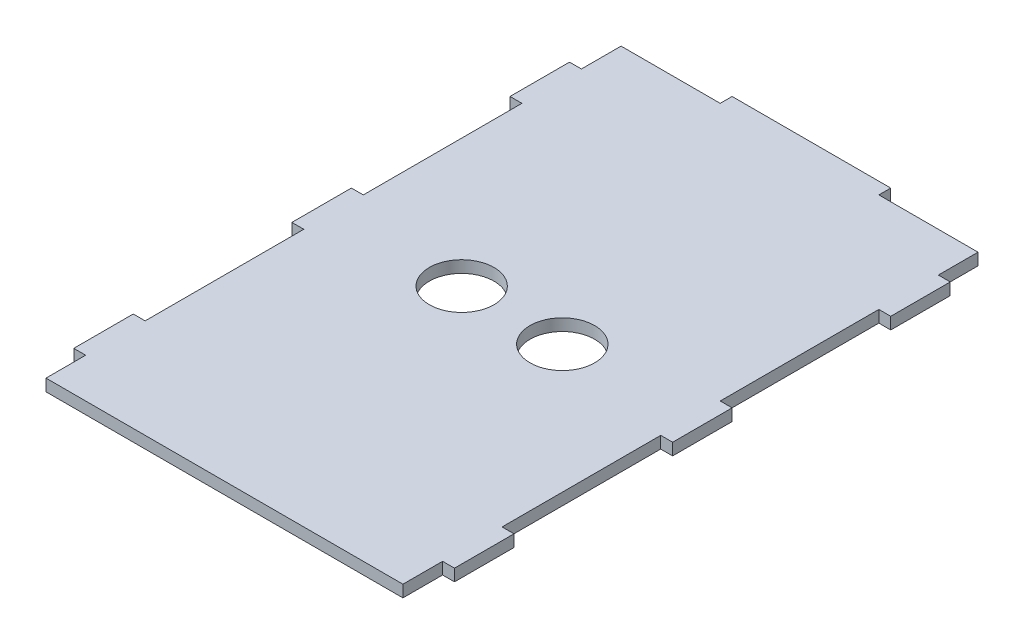
ISO-10303-21;
HEADER;
FILE_DESCRIPTION(('STEP AP214'),'2;1');
FILE_NAME('part.step','',(''),(''),'','','');
FILE_SCHEMA(('AUTOMOTIVE_DESIGN { 1 0 10303 214 1 1 1 1 }'));
ENDSEC;
DATA;
#1=APPLICATION_CONTEXT('core data for automotive mechanical design processes');
#2=APPLICATION_PROTOCOL_DEFINITION('international standard','automotive_design',2000,#1);
#3=PRODUCT_CONTEXT('',#1,'mechanical');
#4=PRODUCT('Part','Part','',(#3));
#5=PRODUCT_RELATED_PRODUCT_CATEGORY('part','',(#4));
#6=PRODUCT_DEFINITION_FORMATION('','',#4);
#7=PRODUCT_DEFINITION_CONTEXT('part definition',#1,'design');
#8=PRODUCT_DEFINITION('design','',#6,#7);
#9=PRODUCT_DEFINITION_SHAPE('','',#8);
#10=(LENGTH_UNIT() NAMED_UNIT(*) SI_UNIT(.MILLI.,.METRE.));
#11=(NAMED_UNIT(*) PLANE_ANGLE_UNIT() SI_UNIT($,.RADIAN.));
#12=(NAMED_UNIT(*) SI_UNIT($,.STERADIAN.) SOLID_ANGLE_UNIT());
#13=UNCERTAINTY_MEASURE_WITH_UNIT(LENGTH_MEASURE(1.E-05),#10,'distance_accuracy_value','');
#14=(GEOMETRIC_REPRESENTATION_CONTEXT(3) GLOBAL_UNCERTAINTY_ASSIGNED_CONTEXT((#13)) GLOBAL_UNIT_ASSIGNED_CONTEXT((#10,
#11,#12)) REPRESENTATION_CONTEXT('',''));
#15=CARTESIAN_POINT('',(0.,0.,0.));
#16=DIRECTION('',(0.,0.,1.));
#17=DIRECTION('',(1.,0.,0.));
#18=AXIS2_PLACEMENT_3D('',#15,#16,#17);
#19=CARTESIAN_POINT('',(0.,0.,-145.));
#20=DIRECTION('',(0.,0.,-1.));
#21=DIRECTION('',(-1.,0.,0.));
#22=AXIS2_PLACEMENT_3D('',#19,#20,#21);
#23=PLANE('',#22);
#24=DIRECTION('',(-1.,0.,0.));
#25=VECTOR('',#24,1.);
#26=CARTESIAN_POINT('',(0.,0.,-145.));
#27=LINE('',#26,#25);
#28=CARTESIAN_POINT('',(90.,0.,-145.));
#29=VERTEX_POINT('',#28);
#30=CARTESIAN_POINT('',(65.,0.,-145.));
#31=VERTEX_POINT('',#30);
#32=EDGE_CURVE('E273',#29,#31,#27,.T.);
#33=ORIENTED_EDGE('',*,*,#32,.T.);
#34=DIRECTION('',(0.,1.,0.));
#35=VECTOR('',#34,1.);
#36=CARTESIAN_POINT('',(65.,0.,-145.));
#37=LINE('',#36,#35);
#38=CARTESIAN_POINT('',(64.9999999999999,3.,-145.));
#39=VERTEX_POINT('',#38);
#40=EDGE_CURVE('E265',#31,#39,#37,.T.);
#41=ORIENTED_EDGE('',*,*,#40,.T.);
#42=DIRECTION('',(-1.,0.,0.));
#43=VECTOR('',#42,1.);
#44=CARTESIAN_POINT('',(0.,3.,-145.));
#45=LINE('',#44,#43);
#46=CARTESIAN_POINT('',(90.,3.,-145.));
#47=VERTEX_POINT('',#46);
#48=EDGE_CURVE('E274',#47,#39,#45,.T.);
#49=ORIENTED_EDGE('',*,*,#48,.F.);
#50=DIRECTION('',(0.,1.,0.));
#51=VECTOR('',#50,1.);
#52=CARTESIAN_POINT('',(90.,0.,-145.));
#53=LINE('',#52,#51);
#54=EDGE_CURVE('E277',#29,#47,#53,.T.);
#55=ORIENTED_EDGE('',*,*,#54,.F.);
#56=EDGE_LOOP('',(#33,#41,#49,#55));
#57=FACE_BOUND('',#56,.T.);
#58=ADVANCED_FACE('F33',(#57),#23,.T.);
#59=CARTESIAN_POINT('',(90.,3.,0.));
#60=DIRECTION('',(-1.,0.,0.));
#61=DIRECTION('',(0.,0.,1.));
#62=AXIS2_PLACEMENT_3D('',#59,#60,#61);
#63=PLANE('',#62);
#64=DIRECTION('',(0.,0.,-1.));
#65=VECTOR('',#64,1.);
#66=CARTESIAN_POINT('',(90.,3.,0.));
#67=LINE('',#66,#65);
#68=CARTESIAN_POINT('',(90.,3.,-25.));
#69=VERTEX_POINT('',#68);
#70=CARTESIAN_POINT('',(90.,3.,-65.));
#71=VERTEX_POINT('',#70);
#72=EDGE_CURVE('E58',#69,#71,#67,.T.);
#73=ORIENTED_EDGE('',*,*,#72,.F.);
#74=DIRECTION('',(0.,1.,0.));
#75=VECTOR('',#74,1.);
#76=CARTESIAN_POINT('',(90.,0.,-25.));
#77=LINE('',#76,#75);
#78=CARTESIAN_POINT('',(90.,0.,-25.));
#79=VERTEX_POINT('',#78);
#80=EDGE_CURVE('E603',#79,#69,#77,.T.);
#81=ORIENTED_EDGE('',*,*,#80,.F.);
#82=DIRECTION('',(0.,0.,-1.));
#83=VECTOR('',#82,1.);
#84=CARTESIAN_POINT('',(90.,0.,0.));
#85=LINE('',#84,#83);
#86=CARTESIAN_POINT('',(90.,0.,-65.));
#87=VERTEX_POINT('',#86);
#88=EDGE_CURVE('E301',#79,#87,#85,.T.);
#89=ORIENTED_EDGE('',*,*,#88,.T.);
#90=DIRECTION('',(0.,1.,0.));
#91=VECTOR('',#90,1.);
#92=CARTESIAN_POINT('',(90.,0.,-65.));
#93=LINE('',#92,#91);
#94=EDGE_CURVE('E515',#87,#71,#93,.T.);
#95=ORIENTED_EDGE('',*,*,#94,.T.);
#96=EDGE_LOOP('',(#73,#81,#89,#95));
#97=FACE_BOUND('',#96,.T.);
#98=ADVANCED_FACE('F632',(#97),#63,.F.);
#99=CARTESIAN_POINT('',(90.,3.,-80.));
#100=VERTEX_POINT('',#99);
#101=CARTESIAN_POINT('',(90.,3.,-120.));
#102=VERTEX_POINT('',#101);
#103=EDGE_CURVE('E300',#100,#102,#67,.T.);
#104=ORIENTED_EDGE('',*,*,#103,.F.);
#105=DIRECTION('',(0.,1.,0.));
#106=VECTOR('',#105,1.);
#107=CARTESIAN_POINT('',(90.,0.,-80.));
#108=LINE('',#107,#106);
#109=CARTESIAN_POINT('',(90.,0.,-80.));
#110=VERTEX_POINT('',#109);
#111=EDGE_CURVE('E500',#110,#100,#108,.T.);
#112=ORIENTED_EDGE('',*,*,#111,.F.);
#113=CARTESIAN_POINT('',(90.,0.,-120.));
#114=VERTEX_POINT('',#113);
#115=EDGE_CURVE('E320',#110,#114,#85,.T.);
#116=ORIENTED_EDGE('',*,*,#115,.T.);
#117=DIRECTION('',(0.,1.,0.));
#118=VECTOR('',#117,1.);
#119=CARTESIAN_POINT('',(90.,0.,-120.));
#120=LINE('',#119,#118);
#121=EDGE_CURVE('E463',#114,#102,#120,.T.);
#122=ORIENTED_EDGE('',*,*,#121,.T.);
#123=EDGE_LOOP('',(#104,#112,#116,#122));
#124=FACE_BOUND('',#123,.T.);
#125=ADVANCED_FACE('F630',(#124),#63,.F.);
#126=DIRECTION('',(0.,1.,0.));
#127=VECTOR('',#126,1.);
#128=CARTESIAN_POINT('',(90.,0.,-135.));
#129=LINE('',#128,#127);
#130=CARTESIAN_POINT('',(90.,0.,-135.));
#131=VERTEX_POINT('',#130);
#132=CARTESIAN_POINT('',(90.,3.,-135.));
#133=VERTEX_POINT('',#132);
#134=EDGE_CURVE('E450',#131,#133,#129,.T.);
#135=ORIENTED_EDGE('',*,*,#134,.F.);
#136=EDGE_CURVE('E322',#131,#29,#85,.T.);
#137=ORIENTED_EDGE('',*,*,#136,.T.);
#138=ORIENTED_EDGE('',*,*,#54,.T.);
#139=EDGE_CURVE('E314',#133,#47,#67,.T.);
#140=ORIENTED_EDGE('',*,*,#139,.F.);
#141=EDGE_LOOP('',(#135,#137,#138,#140));
#142=FACE_BOUND('',#141,.T.);
#143=ADVANCED_FACE('F524',(#142),#63,.F.);
#144=CARTESIAN_POINT('',(0.,3.,0.));
#145=DIRECTION('',(1.,0.,0.));
#146=DIRECTION('',(0.,0.,-1.));
#147=AXIS2_PLACEMENT_3D('',#144,#145,#146);
#148=PLANE('',#147);
#149=DIRECTION('',(0.,0.,1.));
#150=VECTOR('',#149,1.);
#151=CARTESIAN_POINT('',(0.,0.,0.));
#152=LINE('',#151,#150);
#153=CARTESIAN_POINT('',(0.,0.,-65.));
#154=VERTEX_POINT('',#153);
#155=CARTESIAN_POINT('',(0.,0.,-25.));
#156=VERTEX_POINT('',#155);
#157=EDGE_CURVE('E351',#154,#156,#152,.T.);
#158=ORIENTED_EDGE('',*,*,#157,.T.);
#159=DIRECTION('',(0.,1.,0.));
#160=VECTOR('',#159,1.);
#161=CARTESIAN_POINT('',(0.,0.,-25.));
#162=LINE('',#161,#160);
#163=CARTESIAN_POINT('',(0.,3.,-25.));
#164=VERTEX_POINT('',#163);
#165=EDGE_CURVE('E437',#156,#164,#162,.T.);
#166=ORIENTED_EDGE('',*,*,#165,.T.);
#167=DIRECTION('',(0.,0.,1.));
#168=VECTOR('',#167,1.);
#169=CARTESIAN_POINT('',(0.,3.,0.));
#170=LINE('',#169,#168);
#171=CARTESIAN_POINT('',(0.,3.,-65.));
#172=VERTEX_POINT('',#171);
#173=EDGE_CURVE('E336',#172,#164,#170,.T.);
#174=ORIENTED_EDGE('',*,*,#173,.F.);
#175=DIRECTION('',(0.,1.,0.));
#176=VECTOR('',#175,1.);
#177=CARTESIAN_POINT('',(0.,0.,-65.));
#178=LINE('',#177,#176);
#179=EDGE_CURVE('E408',#154,#172,#178,.T.);
#180=ORIENTED_EDGE('',*,*,#179,.F.);
#181=EDGE_LOOP('',(#158,#166,#174,#180));
#182=FACE_BOUND('',#181,.T.);
#183=ADVANCED_FACE('F638',(#182),#148,.F.);
#184=CARTESIAN_POINT('',(0.,0.,-120.));
#185=VERTEX_POINT('',#184);
#186=CARTESIAN_POINT('',(0.,0.,-80.));
#187=VERTEX_POINT('',#186);
#188=EDGE_CURVE('E353',#185,#187,#152,.T.);
#189=ORIENTED_EDGE('',*,*,#188,.T.);
#190=DIRECTION('',(0.,1.,0.));
#191=VECTOR('',#190,1.);
#192=CARTESIAN_POINT('',(0.,0.,-80.));
#193=LINE('',#192,#191);
#194=CARTESIAN_POINT('',(0.,3.,-80.));
#195=VERTEX_POINT('',#194);
#196=EDGE_CURVE('E402',#187,#195,#193,.T.);
#197=ORIENTED_EDGE('',*,*,#196,.T.);
#198=CARTESIAN_POINT('',(0.,3.,-120.));
#199=VERTEX_POINT('',#198);
#200=EDGE_CURVE('E343',#199,#195,#170,.T.);
#201=ORIENTED_EDGE('',*,*,#200,.F.);
#202=DIRECTION('',(0.,1.,0.));
#203=VECTOR('',#202,1.);
#204=CARTESIAN_POINT('',(0.,0.,-120.));
#205=LINE('',#204,#203);
#206=EDGE_CURVE('E367',#185,#199,#205,.T.);
#207=ORIENTED_EDGE('',*,*,#206,.F.);
#208=EDGE_LOOP('',(#189,#197,#201,#207));
#209=FACE_BOUND('',#208,.T.);
#210=ADVANCED_FACE('F538',(#209),#148,.F.);
#211=CARTESIAN_POINT('',(0.,3.,-10.));
#212=VERTEX_POINT('',#211);
#213=CARTESIAN_POINT('',(0.,3.,0.));
#214=VERTEX_POINT('',#213);
#215=EDGE_CURVE('E334',#212,#214,#170,.T.);
#216=ORIENTED_EDGE('',*,*,#215,.F.);
#217=DIRECTION('',(0.,1.,0.));
#218=VECTOR('',#217,1.);
#219=CARTESIAN_POINT('',(0.,0.,-10.));
#220=LINE('',#219,#218);
#221=CARTESIAN_POINT('',(0.,0.,-10.));
#222=VERTEX_POINT('',#221);
#223=EDGE_CURVE('E433',#222,#212,#220,.T.);
#224=ORIENTED_EDGE('',*,*,#223,.F.);
#225=CARTESIAN_POINT('',(0.,0.,0.));
#226=VERTEX_POINT('',#225);
#227=EDGE_CURVE('E337',#222,#226,#152,.T.);
#228=ORIENTED_EDGE('',*,*,#227,.T.);
#229=DIRECTION('',(0.,-1.,0.));
#230=VECTOR('',#229,1.);
#231=CARTESIAN_POINT('',(0.,3.,0.));
#232=LINE('',#231,#230);
#233=EDGE_CURVE('E11',#214,#226,#232,.T.);
#234=ORIENTED_EDGE('',*,*,#233,.F.);
#235=EDGE_LOOP('',(#216,#224,#228,#234));
#236=FACE_BOUND('',#235,.T.);
#237=ADVANCED_FACE('F904',(#236),#148,.F.);
#238=CARTESIAN_POINT('',(0.,0.,-145.));
#239=VERTEX_POINT('',#238);
#240=CARTESIAN_POINT('',(0.,0.,-135.));
#241=VERTEX_POINT('',#240);
#242=EDGE_CURVE('E271',#239,#241,#152,.T.);
#243=ORIENTED_EDGE('',*,*,#242,.T.);
#244=DIRECTION('',(0.,1.,0.));
#245=VECTOR('',#244,1.);
#246=CARTESIAN_POINT('',(0.,0.,-135.));
#247=LINE('',#246,#245);
#248=CARTESIAN_POINT('',(0.,3.,-135.));
#249=VERTEX_POINT('',#248);
#250=EDGE_CURVE('E369',#241,#249,#247,.T.);
#251=ORIENTED_EDGE('',*,*,#250,.T.);
#252=CARTESIAN_POINT('',(0.,3.,-145.));
#253=VERTEX_POINT('',#252);
#254=EDGE_CURVE('E347',#253,#249,#170,.T.);
#255=ORIENTED_EDGE('',*,*,#254,.F.);
#256=DIRECTION('',(0.,1.,0.));
#257=VECTOR('',#256,1.);
#258=CARTESIAN_POINT('',(0.,0.,-145.));
#259=LINE('',#258,#257);
#260=EDGE_CURVE('E293',#239,#253,#259,.T.);
#261=ORIENTED_EDGE('',*,*,#260,.F.);
#262=EDGE_LOOP('',(#243,#251,#255,#261));
#263=FACE_BOUND('',#262,.T.);
#264=ADVANCED_FACE('F35',(#263),#148,.F.);
#265=CARTESIAN_POINT('',(0.,3.,0.));
#266=DIRECTION('',(0.,0.,-1.));
#267=DIRECTION('',(-1.,0.,0.));
#268=AXIS2_PLACEMENT_3D('',#265,#266,#267);
#269=PLANE('',#268);
#270=DIRECTION('',(1.,0.,0.));
#271=VECTOR('',#270,1.);
#272=CARTESIAN_POINT('',(0.,0.,0.));
#273=LINE('',#272,#271);
#274=CARTESIAN_POINT('',(90.,0.,0.));
#275=VERTEX_POINT('',#274);
#276=EDGE_CURVE('E327',#226,#275,#273,.T.);
#277=ORIENTED_EDGE('',*,*,#276,.T.);
#278=DIRECTION('',(0.,-1.,0.));
#279=VECTOR('',#278,1.);
#280=CARTESIAN_POINT('',(90.,3.,0.));
#281=LINE('',#280,#279);
#282=CARTESIAN_POINT('',(90.,3.,0.));
#283=VERTEX_POINT('',#282);
#284=EDGE_CURVE('E42',#283,#275,#281,.T.);
#285=ORIENTED_EDGE('',*,*,#284,.F.);
#286=DIRECTION('',(1.,0.,0.));
#287=VECTOR('',#286,1.);
#288=CARTESIAN_POINT('',(0.,3.,0.));
#289=LINE('',#288,#287);
#290=EDGE_CURVE('E307',#214,#283,#289,.T.);
#291=ORIENTED_EDGE('',*,*,#290,.F.);
#292=ORIENTED_EDGE('',*,*,#233,.T.);
#293=EDGE_LOOP('',(#277,#285,#291,#292));
#294=FACE_BOUND('',#293,.T.);
#295=ADVANCED_FACE('F995',(#294),#269,.F.);
#296=CARTESIAN_POINT('',(90.,0.,-10.));
#297=VERTEX_POINT('',#296);
#298=EDGE_CURVE('E332',#275,#297,#85,.T.);
#299=ORIENTED_EDGE('',*,*,#298,.T.);
#300=DIRECTION('',(0.,1.,0.));
#301=VECTOR('',#300,1.);
#302=CARTESIAN_POINT('',(90.,0.,-10.));
#303=LINE('',#302,#301);
#304=CARTESIAN_POINT('',(90.,3.,-10.));
#305=VERTEX_POINT('',#304);
#306=EDGE_CURVE('E610',#297,#305,#303,.T.);
#307=ORIENTED_EDGE('',*,*,#306,.T.);
#308=EDGE_CURVE('E299',#283,#305,#67,.T.);
#309=ORIENTED_EDGE('',*,*,#308,.F.);
#310=ORIENTED_EDGE('',*,*,#284,.T.);
#311=EDGE_LOOP('',(#299,#307,#309,#310));
#312=FACE_BOUND('',#311,.T.);
#313=ADVANCED_FACE('F639',(#312),#63,.F.);
#314=CARTESIAN_POINT('',(0.,3.,0.));
#315=DIRECTION('',(0.,-1.,0.));
#316=DIRECTION('',(0.,0.,-1.));
#317=AXIS2_PLACEMENT_3D('',#314,#315,#316);
#318=PLANE('',#317);
#319=CARTESIAN_POINT('',(57.69,3.,-72.5));
#320=DIRECTION('',(0.,1.,0.));
#321=DIRECTION('',(0.,0.,1.));
#322=AXIS2_PLACEMENT_3D('',#319,#320,#321);
#323=CIRCLE('',#322,8.15);
#324=CARTESIAN_POINT('',(57.69,3.,-64.35));
#325=VERTEX_POINT('',#324);
#326=EDGE_CURVE('E584',#325,#325,#323,.T.);
#327=ORIENTED_EDGE('',*,*,#326,.F.);
#328=EDGE_LOOP('',(#327));
#329=FACE_BOUND('',#328,.T.);
#330=CARTESIAN_POINT('',(32.31,3.,-72.5));
#331=DIRECTION('',(0.,1.,0.));
#332=DIRECTION('',(0.,0.,1.));
#333=AXIS2_PLACEMENT_3D('',#330,#331,#332);
#334=CIRCLE('',#333,8.15);
#335=CARTESIAN_POINT('',(32.31,3.,-64.35));
#336=VERTEX_POINT('',#335);
#337=EDGE_CURVE('E576',#336,#336,#334,.T.);
#338=ORIENTED_EDGE('',*,*,#337,.F.);
#339=EDGE_LOOP('',(#338));
#340=FACE_BOUND('',#339,.T.);
#341=ORIENTED_EDGE('',*,*,#254,.T.);
#342=DIRECTION('',(-1.,0.,0.));
#343=VECTOR('',#342,1.);
#344=CARTESIAN_POINT('',(-3.00000000000001,3.,-135.));
#345=LINE('',#344,#343);
#346=CARTESIAN_POINT('',(-3.00000000000001,3.,-135.));
#347=VERTEX_POINT('',#346);
#348=EDGE_CURVE('E359',#249,#347,#345,.T.);
#349=ORIENTED_EDGE('',*,*,#348,.T.);
#350=DIRECTION('',(0.,0.,1.));
#351=VECTOR('',#350,1.);
#352=CARTESIAN_POINT('',(-3.00000000000001,3.,-135.));
#353=LINE('',#352,#351);
#354=CARTESIAN_POINT('',(-3.00000000000001,3.,-120.));
#355=VERTEX_POINT('',#354);
#356=EDGE_CURVE('E360',#347,#355,#353,.T.);
#357=ORIENTED_EDGE('',*,*,#356,.T.);
#358=DIRECTION('',(1.,0.,0.));
#359=VECTOR('',#358,1.);
#360=CARTESIAN_POINT('',(-3.00000000000001,3.,-120.));
#361=LINE('',#360,#359);
#362=EDGE_CURVE('E356',#355,#199,#361,.T.);
#363=ORIENTED_EDGE('',*,*,#362,.T.);
#364=ORIENTED_EDGE('',*,*,#200,.T.);
#365=DIRECTION('',(-1.,0.,0.));
#366=VECTOR('',#365,1.);
#367=CARTESIAN_POINT('',(-3.,3.,-80.));
#368=LINE('',#367,#366);
#369=CARTESIAN_POINT('',(-3.,3.,-80.));
#370=VERTEX_POINT('',#369);
#371=EDGE_CURVE('E413',#195,#370,#368,.T.);
#372=ORIENTED_EDGE('',*,*,#371,.T.);
#373=DIRECTION('',(0.,0.,1.));
#374=VECTOR('',#373,1.);
#375=CARTESIAN_POINT('',(-3.,3.,-80.));
#376=LINE('',#375,#374);
#377=CARTESIAN_POINT('',(-3.,3.,-65.));
#378=VERTEX_POINT('',#377);
#379=EDGE_CURVE('E420',#370,#378,#376,.T.);
#380=ORIENTED_EDGE('',*,*,#379,.T.);
#381=DIRECTION('',(1.,0.,0.));
#382=VECTOR('',#381,1.);
#383=CARTESIAN_POINT('',(-3.,3.,-65.));
#384=LINE('',#383,#382);
#385=EDGE_CURVE('E417',#378,#172,#384,.T.);
#386=ORIENTED_EDGE('',*,*,#385,.T.);
#387=ORIENTED_EDGE('',*,*,#173,.T.);
#388=DIRECTION('',(-1.,0.,0.));
#389=VECTOR('',#388,1.);
#390=CARTESIAN_POINT('',(-3.,3.,-25.));
#391=LINE('',#390,#389);
#392=CARTESIAN_POINT('',(-3.,3.,-25.));
#393=VERTEX_POINT('',#392);
#394=EDGE_CURVE('E440',#164,#393,#391,.T.);
#395=ORIENTED_EDGE('',*,*,#394,.T.);
#396=DIRECTION('',(0.,0.,1.));
#397=VECTOR('',#396,1.);
#398=CARTESIAN_POINT('',(-3.,3.,-25.));
#399=LINE('',#398,#397);
#400=CARTESIAN_POINT('',(-3.,3.,-10.));
#401=VERTEX_POINT('',#400);
#402=EDGE_CURVE('E447',#393,#401,#399,.T.);
#403=ORIENTED_EDGE('',*,*,#402,.T.);
#404=DIRECTION('',(1.,0.,0.));
#405=VECTOR('',#404,1.);
#406=CARTESIAN_POINT('',(-3.,3.,-10.));
#407=LINE('',#406,#405);
#408=EDGE_CURVE('E444',#401,#212,#407,.T.);
#409=ORIENTED_EDGE('',*,*,#408,.T.);
#410=ORIENTED_EDGE('',*,*,#215,.T.);
#411=ORIENTED_EDGE('',*,*,#290,.T.);
#412=ORIENTED_EDGE('',*,*,#308,.T.);
#413=DIRECTION('',(1.,0.,0.));
#414=VECTOR('',#413,1.);
#415=CARTESIAN_POINT('',(90.,3.,-10.));
#416=LINE('',#415,#414);
#417=CARTESIAN_POINT('',(93.,3.,-10.));
#418=VERTEX_POINT('',#417);
#419=EDGE_CURVE('E588',#305,#418,#416,.T.);
#420=ORIENTED_EDGE('',*,*,#419,.T.);
#421=DIRECTION('',(0.,0.,-1.));
#422=VECTOR('',#421,1.);
#423=CARTESIAN_POINT('',(93.,3.,-25.));
#424=LINE('',#423,#422);
#425=CARTESIAN_POINT('',(93.,3.,-25.));
#426=VERTEX_POINT('',#425);
#427=EDGE_CURVE('E592',#418,#426,#424,.T.);
#428=ORIENTED_EDGE('',*,*,#427,.T.);
#429=DIRECTION('',(-1.,0.,0.));
#430=VECTOR('',#429,1.);
#431=CARTESIAN_POINT('',(90.,3.,-25.));
#432=LINE('',#431,#430);
#433=EDGE_CURVE('E596',#426,#69,#432,.T.);
#434=ORIENTED_EDGE('',*,*,#433,.T.);
#435=ORIENTED_EDGE('',*,*,#72,.T.);
#436=DIRECTION('',(1.,0.,0.));
#437=VECTOR('',#436,1.);
#438=CARTESIAN_POINT('',(90.,3.,-65.));
#439=LINE('',#438,#437);
#440=CARTESIAN_POINT('',(93.,3.,-65.));
#441=VERTEX_POINT('',#440);
#442=EDGE_CURVE('E605',#71,#441,#439,.T.);
#443=ORIENTED_EDGE('',*,*,#442,.T.);
#444=DIRECTION('',(0.,0.,-1.));
#445=VECTOR('',#444,1.);
#446=CARTESIAN_POINT('',(93.,3.,-80.));
#447=LINE('',#446,#445);
#448=CARTESIAN_POINT('',(93.,3.,-80.));
#449=VERTEX_POINT('',#448);
#450=EDGE_CURVE('E620',#441,#449,#447,.T.);
#451=ORIENTED_EDGE('',*,*,#450,.T.);
#452=DIRECTION('',(-1.,0.,0.));
#453=VECTOR('',#452,1.);
#454=CARTESIAN_POINT('',(90.,3.,-80.));
#455=LINE('',#454,#453);
#456=EDGE_CURVE('E511',#449,#100,#455,.T.);
#457=ORIENTED_EDGE('',*,*,#456,.T.);
#458=ORIENTED_EDGE('',*,*,#103,.T.);
#459=DIRECTION('',(1.,0.,0.));
#460=VECTOR('',#459,1.);
#461=CARTESIAN_POINT('',(90.,3.,-120.));
#462=LINE('',#461,#460);
#463=CARTESIAN_POINT('',(93.,3.,-120.));
#464=VERTEX_POINT('',#463);
#465=EDGE_CURVE('E493',#102,#464,#462,.T.);
#466=ORIENTED_EDGE('',*,*,#465,.T.);
#467=DIRECTION('',(0.,0.,-1.));
#468=VECTOR('',#467,1.);
#469=CARTESIAN_POINT('',(93.,3.,-135.));
#470=LINE('',#469,#468);
#471=CARTESIAN_POINT('',(93.,3.,-135.));
#472=VERTEX_POINT('',#471);
#473=EDGE_CURVE('E482',#464,#472,#470,.T.);
#474=ORIENTED_EDGE('',*,*,#473,.T.);
#475=DIRECTION('',(-1.,0.,0.));
#476=VECTOR('',#475,1.);
#477=CARTESIAN_POINT('',(90.,3.,-135.));
#478=LINE('',#477,#476);
#479=EDGE_CURVE('E473',#472,#133,#478,.T.);
#480=ORIENTED_EDGE('',*,*,#479,.T.);
#481=ORIENTED_EDGE('',*,*,#139,.T.);
#482=ORIENTED_EDGE('',*,*,#48,.T.);
#483=DIRECTION('',(0.,0.,-1.));
#484=VECTOR('',#483,1.);
#485=CARTESIAN_POINT('',(65.,3.,-148.));
#486=LINE('',#485,#484);
#487=CARTESIAN_POINT('',(65.,3.,-148.));
#488=VERTEX_POINT('',#487);
#489=EDGE_CURVE('E50',#39,#488,#486,.T.);
#490=ORIENTED_EDGE('',*,*,#489,.T.);
#491=DIRECTION('',(-1.,0.,0.));
#492=VECTOR('',#491,1.);
#493=CARTESIAN_POINT('',(25.,3.,-148.));
#494=LINE('',#493,#492);
#495=CARTESIAN_POINT('',(25.,3.,-148.));
#496=VERTEX_POINT('',#495);
#497=EDGE_CURVE('E256',#488,#496,#494,.T.);
#498=ORIENTED_EDGE('',*,*,#497,.T.);
#499=DIRECTION('',(0.,0.,1.));
#500=VECTOR('',#499,1.);
#501=CARTESIAN_POINT('',(25.,3.,-148.));
#502=LINE('',#501,#500);
#503=CARTESIAN_POINT('',(25.,3.,-145.));
#504=VERTEX_POINT('',#503);
#505=EDGE_CURVE('E572',#496,#504,#502,.T.);
#506=ORIENTED_EDGE('',*,*,#505,.T.);
#507=EDGE_CURVE('E264',#504,#253,#45,.T.);
#508=ORIENTED_EDGE('',*,*,#507,.T.);
#509=EDGE_LOOP('',(#341,#349,#357,#363,#364,#372,#380,#386,#387,#395,#403,#409,#410,#411,#412,
#420,#428,#434,#435,#443,#451,#457,#458,#466,#474,#480,#481,#482,#490,#498,#506,#508));
#510=FACE_BOUND('',#509,.T.);
#511=ADVANCED_FACE('F400',(#329,#340,#510),#318,.F.);
#512=CARTESIAN_POINT('',(0.,0.,0.));
#513=DIRECTION('',(0.,-1.,0.));
#514=DIRECTION('',(0.,0.,-1.));
#515=AXIS2_PLACEMENT_3D('',#512,#513,#514);
#516=PLANE('',#515);
#517=CARTESIAN_POINT('',(57.69,0.,-72.5));
#518=DIRECTION('',(0.,1.,0.));
#519=DIRECTION('',(0.,0.,1.));
#520=AXIS2_PLACEMENT_3D('',#517,#518,#519);
#521=CIRCLE('',#520,8.15);
#522=CARTESIAN_POINT('',(57.69,0.,-64.35));
#523=VERTEX_POINT('',#522);
#524=EDGE_CURVE('E581',#523,#523,#521,.T.);
#525=ORIENTED_EDGE('',*,*,#524,.T.);
#526=EDGE_LOOP('',(#525));
#527=FACE_BOUND('',#526,.T.);
#528=CARTESIAN_POINT('',(32.31,0.,-72.5));
#529=DIRECTION('',(0.,1.,0.));
#530=DIRECTION('',(0.,0.,1.));
#531=AXIS2_PLACEMENT_3D('',#528,#529,#530);
#532=CIRCLE('',#531,8.15);
#533=CARTESIAN_POINT('',(32.31,0.,-64.35));
#534=VERTEX_POINT('',#533);
#535=EDGE_CURVE('E573',#534,#534,#532,.T.);
#536=ORIENTED_EDGE('',*,*,#535,.T.);
#537=EDGE_LOOP('',(#536));
#538=FACE_BOUND('',#537,.T.);
#539=ORIENTED_EDGE('',*,*,#242,.F.);
#540=CARTESIAN_POINT('',(25.,0.,-145.));
#541=VERTEX_POINT('',#540);
#542=EDGE_CURVE('E262',#541,#239,#27,.T.);
#543=ORIENTED_EDGE('',*,*,#542,.F.);
#544=DIRECTION('',(0.,0.,1.));
#545=VECTOR('',#544,1.);
#546=CARTESIAN_POINT('',(25.,0.,-148.));
#547=LINE('',#546,#545);
#548=CARTESIAN_POINT('',(25.,0.,-148.));
#549=VERTEX_POINT('',#548);
#550=EDGE_CURVE('E244',#549,#541,#547,.T.);
#551=ORIENTED_EDGE('',*,*,#550,.F.);
#552=DIRECTION('',(-1.,0.,0.));
#553=VECTOR('',#552,1.);
#554=CARTESIAN_POINT('',(25.,0.,-148.));
#555=LINE('',#554,#553);
#556=CARTESIAN_POINT('',(65.,0.,-148.));
#557=VERTEX_POINT('',#556);
#558=EDGE_CURVE('E266',#557,#549,#555,.T.);
#559=ORIENTED_EDGE('',*,*,#558,.F.);
#560=DIRECTION('',(0.,0.,-1.));
#561=VECTOR('',#560,1.);
#562=CARTESIAN_POINT('',(65.,0.,-148.));
#563=LINE('',#562,#561);
#564=EDGE_CURVE('E255',#31,#557,#563,.T.);
#565=ORIENTED_EDGE('',*,*,#564,.F.);
#566=ORIENTED_EDGE('',*,*,#32,.F.);
#567=ORIENTED_EDGE('',*,*,#136,.F.);
#568=DIRECTION('',(-1.,0.,0.));
#569=VECTOR('',#568,1.);
#570=CARTESIAN_POINT('',(90.,0.,-135.));
#571=LINE('',#570,#569);
#572=CARTESIAN_POINT('',(93.,0.,-135.));
#573=VERTEX_POINT('',#572);
#574=EDGE_CURVE('E467',#573,#131,#571,.T.);
#575=ORIENTED_EDGE('',*,*,#574,.F.);
#576=DIRECTION('',(0.,0.,-1.));
#577=VECTOR('',#576,1.);
#578=CARTESIAN_POINT('',(93.,0.,-135.));
#579=LINE('',#578,#577);
#580=CARTESIAN_POINT('',(93.,0.,-120.));
#581=VERTEX_POINT('',#580);
#582=EDGE_CURVE('E472',#581,#573,#579,.T.);
#583=ORIENTED_EDGE('',*,*,#582,.F.);
#584=DIRECTION('',(1.,0.,0.));
#585=VECTOR('',#584,1.);
#586=CARTESIAN_POINT('',(90.,0.,-120.));
#587=LINE('',#586,#585);
#588=EDGE_CURVE('E469',#114,#581,#587,.T.);
#589=ORIENTED_EDGE('',*,*,#588,.F.);
#590=ORIENTED_EDGE('',*,*,#115,.F.);
#591=DIRECTION('',(-1.,0.,0.));
#592=VECTOR('',#591,1.);
#593=CARTESIAN_POINT('',(90.,0.,-80.));
#594=LINE('',#593,#592);
#595=CARTESIAN_POINT('',(93.,0.,-80.));
#596=VERTEX_POINT('',#595);
#597=EDGE_CURVE('E516',#596,#110,#594,.T.);
#598=ORIENTED_EDGE('',*,*,#597,.F.);
#599=DIRECTION('',(0.,0.,-1.));
#600=VECTOR('',#599,1.);
#601=CARTESIAN_POINT('',(93.,0.,-80.));
#602=LINE('',#601,#600);
#603=CARTESIAN_POINT('',(93.,0.,-65.));
#604=VERTEX_POINT('',#603);
#605=EDGE_CURVE('E615',#604,#596,#602,.T.);
#606=ORIENTED_EDGE('',*,*,#605,.F.);
#607=DIRECTION('',(1.,0.,0.));
#608=VECTOR('',#607,1.);
#609=CARTESIAN_POINT('',(90.,0.,-65.));
#610=LINE('',#609,#608);
#611=EDGE_CURVE('E612',#87,#604,#610,.T.);
#612=ORIENTED_EDGE('',*,*,#611,.F.);
#613=ORIENTED_EDGE('',*,*,#88,.F.);
#614=DIRECTION('',(-1.,0.,0.));
#615=VECTOR('',#614,1.);
#616=CARTESIAN_POINT('',(90.,0.,-25.));
#617=LINE('',#616,#615);
#618=CARTESIAN_POINT('',(93.,0.,-25.));
#619=VERTEX_POINT('',#618);
#620=EDGE_CURVE('E599',#619,#79,#617,.T.);
#621=ORIENTED_EDGE('',*,*,#620,.F.);
#622=DIRECTION('',(0.,0.,-1.));
#623=VECTOR('',#622,1.);
#624=CARTESIAN_POINT('',(93.,0.,-25.));
#625=LINE('',#624,#623);
#626=CARTESIAN_POINT('',(93.,0.,-10.));
#627=VERTEX_POINT('',#626);
#628=EDGE_CURVE('E1029',#627,#619,#625,.T.);
#629=ORIENTED_EDGE('',*,*,#628,.F.);
#630=DIRECTION('',(1.,0.,0.));
#631=VECTOR('',#630,1.);
#632=CARTESIAN_POINT('',(90.,0.,-10.));
#633=LINE('',#632,#631);
#634=EDGE_CURVE('E567',#297,#627,#633,.T.);
#635=ORIENTED_EDGE('',*,*,#634,.F.);
#636=ORIENTED_EDGE('',*,*,#298,.F.);
#637=ORIENTED_EDGE('',*,*,#276,.F.);
#638=ORIENTED_EDGE('',*,*,#227,.F.);
#639=DIRECTION('',(1.,0.,0.));
#640=VECTOR('',#639,1.);
#641=CARTESIAN_POINT('',(-3.,0.,-10.));
#642=LINE('',#641,#640);
#643=CARTESIAN_POINT('',(-3.,0.,-10.));
#644=VERTEX_POINT('',#643);
#645=EDGE_CURVE('E453',#644,#222,#642,.T.);
#646=ORIENTED_EDGE('',*,*,#645,.F.);
#647=DIRECTION('',(0.,0.,1.));
#648=VECTOR('',#647,1.);
#649=CARTESIAN_POINT('',(-3.,0.,-25.));
#650=LINE('',#649,#648);
#651=CARTESIAN_POINT('',(-3.,0.,-25.));
#652=VERTEX_POINT('',#651);
#653=EDGE_CURVE('E443',#652,#644,#650,.T.);
#654=ORIENTED_EDGE('',*,*,#653,.F.);
#655=DIRECTION('',(-1.,0.,0.));
#656=VECTOR('',#655,1.);
#657=CARTESIAN_POINT('',(-3.,0.,-25.));
#658=LINE('',#657,#656);
#659=EDGE_CURVE('E434',#156,#652,#658,.T.);
#660=ORIENTED_EDGE('',*,*,#659,.F.);
#661=ORIENTED_EDGE('',*,*,#157,.F.);
#662=DIRECTION('',(1.,0.,0.));
#663=VECTOR('',#662,1.);
#664=CARTESIAN_POINT('',(-3.,0.,-65.));
#665=LINE('',#664,#663);
#666=CARTESIAN_POINT('',(-3.,0.,-65.));
#667=VERTEX_POINT('',#666);
#668=EDGE_CURVE('E426',#667,#154,#665,.T.);
#669=ORIENTED_EDGE('',*,*,#668,.F.);
#670=DIRECTION('',(0.,0.,1.));
#671=VECTOR('',#670,1.);
#672=CARTESIAN_POINT('',(-3.,0.,-80.));
#673=LINE('',#672,#671);
#674=CARTESIAN_POINT('',(-3.,0.,-80.));
#675=VERTEX_POINT('',#674);
#676=EDGE_CURVE('E416',#675,#667,#673,.T.);
#677=ORIENTED_EDGE('',*,*,#676,.F.);
#678=DIRECTION('',(-1.,0.,0.));
#679=VECTOR('',#678,1.);
#680=CARTESIAN_POINT('',(-3.,0.,-80.));
#681=LINE('',#680,#679);
#682=EDGE_CURVE('E409',#187,#675,#681,.T.);
#683=ORIENTED_EDGE('',*,*,#682,.F.);
#684=ORIENTED_EDGE('',*,*,#188,.F.);
#685=DIRECTION('',(1.,0.,0.));
#686=VECTOR('',#685,1.);
#687=CARTESIAN_POINT('',(-3.00000000000001,0.,-120.));
#688=LINE('',#687,#686);
#689=CARTESIAN_POINT('',(-3.00000000000001,0.,-120.));
#690=VERTEX_POINT('',#689);
#691=EDGE_CURVE('E363',#690,#185,#688,.T.);
#692=ORIENTED_EDGE('',*,*,#691,.F.);
#693=DIRECTION('',(0.,0.,1.));
#694=VECTOR('',#693,1.);
#695=CARTESIAN_POINT('',(-3.00000000000001,0.,-135.));
#696=LINE('',#695,#694);
#697=CARTESIAN_POINT('',(-3.00000000000001,0.,-135.));
#698=VERTEX_POINT('',#697);
#699=EDGE_CURVE('E366',#698,#690,#696,.T.);
#700=ORIENTED_EDGE('',*,*,#699,.F.);
#701=DIRECTION('',(-1.,0.,0.));
#702=VECTOR('',#701,1.);
#703=CARTESIAN_POINT('',(-3.00000000000001,0.,-135.));
#704=LINE('',#703,#702);
#705=EDGE_CURVE('E365',#241,#698,#704,.T.);
#706=ORIENTED_EDGE('',*,*,#705,.F.);
#707=EDGE_LOOP('',(#539,#543,#551,#559,#565,#566,#567,#575,#583,#589,#590,#598,#606,#612,#613,
#621,#629,#635,#636,#637,#638,#646,#654,#660,#661,#669,#677,#683,#684,#692,#700,#706));
#708=FACE_BOUND('',#707,.T.);
#709=ADVANCED_FACE('F268',(#527,#538,#708),#516,.T.);
#710=DIRECTION('',(0.,1.,0.));
#711=VECTOR('',#710,1.);
#712=CARTESIAN_POINT('',(25.,0.,-145.));
#713=LINE('',#712,#711);
#714=EDGE_CURVE('E248',#541,#504,#713,.T.);
#715=ORIENTED_EDGE('',*,*,#714,.F.);
#716=ORIENTED_EDGE('',*,*,#542,.T.);
#717=ORIENTED_EDGE('',*,*,#260,.T.);
#718=ORIENTED_EDGE('',*,*,#507,.F.);
#719=EDGE_LOOP('',(#715,#716,#717,#718));
#720=FACE_BOUND('',#719,.T.);
#721=ADVANCED_FACE('F260',(#720),#23,.T.);
#722=CARTESIAN_POINT('',(-3.00000000000001,0.,-135.));
#723=DIRECTION('',(-1.,0.,0.));
#724=DIRECTION('',(0.,0.,1.));
#725=AXIS2_PLACEMENT_3D('',#722,#723,#724);
#726=PLANE('',#725);
#727=ORIENTED_EDGE('',*,*,#356,.F.);
#728=DIRECTION('',(0.,1.,0.));
#729=VECTOR('',#728,1.);
#730=CARTESIAN_POINT('',(-3.00000000000001,0.,-135.));
#731=LINE('',#730,#729);
#732=EDGE_CURVE('E376',#698,#347,#731,.T.);
#733=ORIENTED_EDGE('',*,*,#732,.F.);
#734=ORIENTED_EDGE('',*,*,#699,.T.);
#735=DIRECTION('',(0.,1.,0.));
#736=VECTOR('',#735,1.);
#737=CARTESIAN_POINT('',(-3.00000000000001,0.,-120.));
#738=LINE('',#737,#736);
#739=EDGE_CURVE('E288',#690,#355,#738,.T.);
#740=ORIENTED_EDGE('',*,*,#739,.T.);
#741=EDGE_LOOP('',(#727,#733,#734,#740));
#742=FACE_BOUND('',#741,.T.);
#743=ADVANCED_FACE('F388',(#742),#726,.T.);
#744=CARTESIAN_POINT('',(-3.00000000000001,0.,-135.));
#745=DIRECTION('',(0.,0.,-1.));
#746=DIRECTION('',(-1.,0.,0.));
#747=AXIS2_PLACEMENT_3D('',#744,#745,#746);
#748=PLANE('',#747);
#749=ORIENTED_EDGE('',*,*,#348,.F.);
#750=ORIENTED_EDGE('',*,*,#250,.F.);
#751=ORIENTED_EDGE('',*,*,#705,.T.);
#752=ORIENTED_EDGE('',*,*,#732,.T.);
#753=EDGE_LOOP('',(#749,#750,#751,#752));
#754=FACE_BOUND('',#753,.T.);
#755=ADVANCED_FACE('F652',(#754),#748,.T.);
#756=CARTESIAN_POINT('',(-3.00000000000001,0.,-120.));
#757=DIRECTION('',(0.,0.,1.));
#758=DIRECTION('',(1.,0.,0.));
#759=AXIS2_PLACEMENT_3D('',#756,#757,#758);
#760=PLANE('',#759);
#761=ORIENTED_EDGE('',*,*,#362,.F.);
#762=ORIENTED_EDGE('',*,*,#739,.F.);
#763=ORIENTED_EDGE('',*,*,#691,.T.);
#764=ORIENTED_EDGE('',*,*,#206,.T.);
#765=EDGE_LOOP('',(#761,#762,#763,#764));
#766=FACE_BOUND('',#765,.T.);
#767=ADVANCED_FACE('F394',(#766),#760,.T.);
#768=CARTESIAN_POINT('',(-3.,0.,-80.));
#769=DIRECTION('',(-1.,0.,0.));
#770=DIRECTION('',(0.,0.,1.));
#771=AXIS2_PLACEMENT_3D('',#768,#769,#770);
#772=PLANE('',#771);
#773=ORIENTED_EDGE('',*,*,#379,.F.);
#774=DIRECTION('',(0.,1.,0.));
#775=VECTOR('',#774,1.);
#776=CARTESIAN_POINT('',(-3.,0.,-80.));
#777=LINE('',#776,#775);
#778=EDGE_CURVE('E401',#675,#370,#777,.T.);
#779=ORIENTED_EDGE('',*,*,#778,.F.);
#780=ORIENTED_EDGE('',*,*,#676,.T.);
#781=DIRECTION('',(0.,1.,0.));
#782=VECTOR('',#781,1.);
#783=CARTESIAN_POINT('',(-3.,0.,-65.));
#784=LINE('',#783,#782);
#785=EDGE_CURVE('E406',#667,#378,#784,.T.);
#786=ORIENTED_EDGE('',*,*,#785,.T.);
#787=EDGE_LOOP('',(#773,#779,#780,#786));
#788=FACE_BOUND('',#787,.T.);
#789=ADVANCED_FACE('F547',(#788),#772,.T.);
#790=CARTESIAN_POINT('',(-3.,0.,-80.));
#791=DIRECTION('',(0.,0.,-1.));
#792=DIRECTION('',(-1.,0.,0.));
#793=AXIS2_PLACEMENT_3D('',#790,#791,#792);
#794=PLANE('',#793);
#795=ORIENTED_EDGE('',*,*,#371,.F.);
#796=ORIENTED_EDGE('',*,*,#196,.F.);
#797=ORIENTED_EDGE('',*,*,#682,.T.);
#798=ORIENTED_EDGE('',*,*,#778,.T.);
#799=EDGE_LOOP('',(#795,#796,#797,#798));
#800=FACE_BOUND('',#799,.T.);
#801=ADVANCED_FACE('F542',(#800),#794,.T.);
#802=CARTESIAN_POINT('',(-3.,0.,-65.));
#803=DIRECTION('',(0.,0.,1.));
#804=DIRECTION('',(1.,0.,0.));
#805=AXIS2_PLACEMENT_3D('',#802,#803,#804);
#806=PLANE('',#805);
#807=ORIENTED_EDGE('',*,*,#385,.F.);
#808=ORIENTED_EDGE('',*,*,#785,.F.);
#809=ORIENTED_EDGE('',*,*,#668,.T.);
#810=ORIENTED_EDGE('',*,*,#179,.T.);
#811=EDGE_LOOP('',(#807,#808,#809,#810));
#812=FACE_BOUND('',#811,.T.);
#813=ADVANCED_FACE('F722',(#812),#806,.T.);
#814=CARTESIAN_POINT('',(-3.,0.,-25.));
#815=DIRECTION('',(-1.,0.,0.));
#816=DIRECTION('',(0.,0.,1.));
#817=AXIS2_PLACEMENT_3D('',#814,#815,#816);
#818=PLANE('',#817);
#819=ORIENTED_EDGE('',*,*,#402,.F.);
#820=DIRECTION('',(0.,1.,0.));
#821=VECTOR('',#820,1.);
#822=CARTESIAN_POINT('',(-3.,0.,-25.));
#823=LINE('',#822,#821);
#824=EDGE_CURVE('E423',#652,#393,#823,.T.);
#825=ORIENTED_EDGE('',*,*,#824,.F.);
#826=ORIENTED_EDGE('',*,*,#653,.T.);
#827=DIRECTION('',(0.,1.,0.));
#828=VECTOR('',#827,1.);
#829=CARTESIAN_POINT('',(-3.,0.,-10.));
#830=LINE('',#829,#828);
#831=EDGE_CURVE('E431',#644,#401,#830,.T.);
#832=ORIENTED_EDGE('',*,*,#831,.T.);
#833=EDGE_LOOP('',(#819,#825,#826,#832));
#834=FACE_BOUND('',#833,.T.);
#835=ADVANCED_FACE('F715',(#834),#818,.T.);
#836=CARTESIAN_POINT('',(-3.,0.,-25.));
#837=DIRECTION('',(0.,0.,-1.));
#838=DIRECTION('',(-1.,0.,0.));
#839=AXIS2_PLACEMENT_3D('',#836,#837,#838);
#840=PLANE('',#839);
#841=ORIENTED_EDGE('',*,*,#394,.F.);
#842=ORIENTED_EDGE('',*,*,#165,.F.);
#843=ORIENTED_EDGE('',*,*,#659,.T.);
#844=ORIENTED_EDGE('',*,*,#824,.T.);
#845=EDGE_LOOP('',(#841,#842,#843,#844));
#846=FACE_BOUND('',#845,.T.);
#847=ADVANCED_FACE('F712',(#846),#840,.T.);
#848=CARTESIAN_POINT('',(-3.,0.,-10.));
#849=DIRECTION('',(0.,0.,1.));
#850=DIRECTION('',(1.,0.,0.));
#851=AXIS2_PLACEMENT_3D('',#848,#849,#850);
#852=PLANE('',#851);
#853=ORIENTED_EDGE('',*,*,#408,.F.);
#854=ORIENTED_EDGE('',*,*,#831,.F.);
#855=ORIENTED_EDGE('',*,*,#645,.T.);
#856=ORIENTED_EDGE('',*,*,#223,.T.);
#857=EDGE_LOOP('',(#853,#854,#855,#856));
#858=FACE_BOUND('',#857,.T.);
#859=ADVANCED_FACE('F707',(#858),#852,.T.);
#860=CARTESIAN_POINT('',(90.,0.,-135.));
#861=DIRECTION('',(0.,0.,-1.));
#862=DIRECTION('',(-1.,0.,0.));
#863=AXIS2_PLACEMENT_3D('',#860,#861,#862);
#864=PLANE('',#863);
#865=ORIENTED_EDGE('',*,*,#479,.F.);
#866=DIRECTION('',(0.,1.,0.));
#867=VECTOR('',#866,1.);
#868=CARTESIAN_POINT('',(93.,0.,-135.));
#869=LINE('',#868,#867);
#870=EDGE_CURVE('E478',#573,#472,#869,.T.);
#871=ORIENTED_EDGE('',*,*,#870,.F.);
#872=ORIENTED_EDGE('',*,*,#574,.T.);
#873=ORIENTED_EDGE('',*,*,#134,.T.);
#874=EDGE_LOOP('',(#865,#871,#872,#873));
#875=FACE_BOUND('',#874,.T.);
#876=ADVANCED_FACE('F520',(#875),#864,.T.);
#877=CARTESIAN_POINT('',(93.,0.,-135.));
#878=DIRECTION('',(1.,0.,0.));
#879=DIRECTION('',(0.,0.,-1.));
#880=AXIS2_PLACEMENT_3D('',#877,#878,#879);
#881=PLANE('',#880);
#882=ORIENTED_EDGE('',*,*,#473,.F.);
#883=DIRECTION('',(0.,1.,0.));
#884=VECTOR('',#883,1.);
#885=CARTESIAN_POINT('',(93.,0.,-120.));
#886=LINE('',#885,#884);
#887=EDGE_CURVE('E460',#581,#464,#886,.T.);
#888=ORIENTED_EDGE('',*,*,#887,.F.);
#889=ORIENTED_EDGE('',*,*,#582,.T.);
#890=ORIENTED_EDGE('',*,*,#870,.T.);
#891=EDGE_LOOP('',(#882,#888,#889,#890));
#892=FACE_BOUND('',#891,.T.);
#893=ADVANCED_FACE('F496',(#892),#881,.T.);
#894=CARTESIAN_POINT('',(90.,0.,-120.));
#895=DIRECTION('',(0.,0.,1.));
#896=DIRECTION('',(1.,0.,0.));
#897=AXIS2_PLACEMENT_3D('',#894,#895,#896);
#898=PLANE('',#897);
#899=ORIENTED_EDGE('',*,*,#465,.F.);
#900=ORIENTED_EDGE('',*,*,#121,.F.);
#901=ORIENTED_EDGE('',*,*,#588,.T.);
#902=ORIENTED_EDGE('',*,*,#887,.T.);
#903=EDGE_LOOP('',(#899,#900,#901,#902));
#904=FACE_BOUND('',#903,.T.);
#905=ADVANCED_FACE('F490',(#904),#898,.T.);
#906=CARTESIAN_POINT('',(90.,0.,-80.));
#907=DIRECTION('',(0.,0.,-1.));
#908=DIRECTION('',(-1.,0.,0.));
#909=AXIS2_PLACEMENT_3D('',#906,#907,#908);
#910=PLANE('',#909);
#911=ORIENTED_EDGE('',*,*,#456,.F.);
#912=DIRECTION('',(0.,1.,0.));
#913=VECTOR('',#912,1.);
#914=CARTESIAN_POINT('',(93.,0.,-80.));
#915=LINE('',#914,#913);
#916=EDGE_CURVE('E502',#596,#449,#915,.T.);
#917=ORIENTED_EDGE('',*,*,#916,.F.);
#918=ORIENTED_EDGE('',*,*,#597,.T.);
#919=ORIENTED_EDGE('',*,*,#111,.T.);
#920=EDGE_LOOP('',(#911,#917,#918,#919));
#921=FACE_BOUND('',#920,.T.);
#922=ADVANCED_FACE('F623',(#921),#910,.T.);
#923=CARTESIAN_POINT('',(93.,0.,-80.));
#924=DIRECTION('',(1.,0.,0.));
#925=DIRECTION('',(0.,0.,-1.));
#926=AXIS2_PLACEMENT_3D('',#923,#924,#925);
#927=PLANE('',#926);
#928=ORIENTED_EDGE('',*,*,#450,.F.);
#929=DIRECTION('',(0.,1.,0.));
#930=VECTOR('',#929,1.);
#931=CARTESIAN_POINT('',(93.,0.,-65.));
#932=LINE('',#931,#930);
#933=EDGE_CURVE('E508',#604,#441,#932,.T.);
#934=ORIENTED_EDGE('',*,*,#933,.F.);
#935=ORIENTED_EDGE('',*,*,#605,.T.);
#936=ORIENTED_EDGE('',*,*,#916,.T.);
#937=EDGE_LOOP('',(#928,#934,#935,#936));
#938=FACE_BOUND('',#937,.T.);
#939=ADVANCED_FACE('F627',(#938),#927,.T.);
#940=CARTESIAN_POINT('',(90.,0.,-65.));
#941=DIRECTION('',(0.,0.,1.));
#942=DIRECTION('',(1.,0.,0.));
#943=AXIS2_PLACEMENT_3D('',#940,#941,#942);
#944=PLANE('',#943);
#945=ORIENTED_EDGE('',*,*,#442,.F.);
#946=ORIENTED_EDGE('',*,*,#94,.F.);
#947=ORIENTED_EDGE('',*,*,#611,.T.);
#948=ORIENTED_EDGE('',*,*,#933,.T.);
#949=EDGE_LOOP('',(#945,#946,#947,#948));
#950=FACE_BOUND('',#949,.T.);
#951=ADVANCED_FACE('F690',(#950),#944,.T.);
#952=CARTESIAN_POINT('',(90.,0.,-25.));
#953=DIRECTION('',(0.,0.,-1.));
#954=DIRECTION('',(-1.,0.,0.));
#955=AXIS2_PLACEMENT_3D('',#952,#953,#954);
#956=PLANE('',#955);
#957=ORIENTED_EDGE('',*,*,#433,.F.);
#958=DIRECTION('',(0.,1.,0.));
#959=VECTOR('',#958,1.);
#960=CARTESIAN_POINT('',(93.,0.,-25.));
#961=LINE('',#960,#959);
#962=EDGE_CURVE('E606',#619,#426,#961,.T.);
#963=ORIENTED_EDGE('',*,*,#962,.F.);
#964=ORIENTED_EDGE('',*,*,#620,.T.);
#965=ORIENTED_EDGE('',*,*,#80,.T.);
#966=EDGE_LOOP('',(#957,#963,#964,#965));
#967=FACE_BOUND('',#966,.T.);
#968=ADVANCED_FACE('F686',(#967),#956,.T.);
#969=CARTESIAN_POINT('',(93.,0.,-25.));
#970=DIRECTION('',(1.,0.,0.));
#971=DIRECTION('',(0.,0.,-1.));
#972=AXIS2_PLACEMENT_3D('',#969,#970,#971);
#973=PLANE('',#972);
#974=ORIENTED_EDGE('',*,*,#427,.F.);
#975=DIRECTION('',(0.,1.,0.));
#976=VECTOR('',#975,1.);
#977=CARTESIAN_POINT('',(93.,0.,-10.));
#978=LINE('',#977,#976);
#979=EDGE_CURVE('E608',#627,#418,#978,.T.);
#980=ORIENTED_EDGE('',*,*,#979,.F.);
#981=ORIENTED_EDGE('',*,*,#628,.T.);
#982=ORIENTED_EDGE('',*,*,#962,.T.);
#983=EDGE_LOOP('',(#974,#980,#981,#982));
#984=FACE_BOUND('',#983,.T.);
#985=ADVANCED_FACE('F689',(#984),#973,.T.);
#986=CARTESIAN_POINT('',(90.,0.,-10.));
#987=DIRECTION('',(0.,0.,1.));
#988=DIRECTION('',(1.,0.,0.));
#989=AXIS2_PLACEMENT_3D('',#986,#987,#988);
#990=PLANE('',#989);
#991=ORIENTED_EDGE('',*,*,#419,.F.);
#992=ORIENTED_EDGE('',*,*,#306,.F.);
#993=ORIENTED_EDGE('',*,*,#634,.T.);
#994=ORIENTED_EDGE('',*,*,#979,.T.);
#995=EDGE_LOOP('',(#991,#992,#993,#994));
#996=FACE_BOUND('',#995,.T.);
#997=ADVANCED_FACE('F685',(#996),#990,.T.);
#998=CARTESIAN_POINT('',(25.,0.,-148.));
#999=DIRECTION('',(-1.,0.,0.));
#1000=DIRECTION('',(0.,0.,1.));
#1001=AXIS2_PLACEMENT_3D('',#998,#999,#1000);
#1002=PLANE('',#1001);
#1003=ORIENTED_EDGE('',*,*,#505,.F.);
#1004=DIRECTION('',(0.,1.,0.));
#1005=VECTOR('',#1004,1.);
#1006=CARTESIAN_POINT('',(25.,0.,-148.));
#1007=LINE('',#1006,#1005);
#1008=EDGE_CURVE('E250',#549,#496,#1007,.T.);
#1009=ORIENTED_EDGE('',*,*,#1008,.F.);
#1010=ORIENTED_EDGE('',*,*,#550,.T.);
#1011=ORIENTED_EDGE('',*,*,#714,.T.);
#1012=EDGE_LOOP('',(#1003,#1009,#1010,#1011));
#1013=FACE_BOUND('',#1012,.T.);
#1014=ADVANCED_FACE('F247',(#1013),#1002,.T.);
#1015=CARTESIAN_POINT('',(25.,0.,-148.));
#1016=DIRECTION('',(0.,0.,-1.));
#1017=DIRECTION('',(-1.,0.,0.));
#1018=AXIS2_PLACEMENT_3D('',#1015,#1016,#1017);
#1019=PLANE('',#1018);
#1020=ORIENTED_EDGE('',*,*,#497,.F.);
#1021=DIRECTION('',(0.,1.,0.));
#1022=VECTOR('',#1021,1.);
#1023=CARTESIAN_POINT('',(65.,0.,-148.));
#1024=LINE('',#1023,#1022);
#1025=EDGE_CURVE('E555',#557,#488,#1024,.T.);
#1026=ORIENTED_EDGE('',*,*,#1025,.F.);
#1027=ORIENTED_EDGE('',*,*,#558,.T.);
#1028=ORIENTED_EDGE('',*,*,#1008,.T.);
#1029=EDGE_LOOP('',(#1020,#1026,#1027,#1028));
#1030=FACE_BOUND('',#1029,.T.);
#1031=ADVANCED_FACE('F678',(#1030),#1019,.T.);
#1032=CARTESIAN_POINT('',(65.,0.,-148.));
#1033=DIRECTION('',(1.,0.,0.));
#1034=DIRECTION('',(0.,0.,-1.));
#1035=AXIS2_PLACEMENT_3D('',#1032,#1033,#1034);
#1036=PLANE('',#1035);
#1037=ORIENTED_EDGE('',*,*,#489,.F.);
#1038=ORIENTED_EDGE('',*,*,#40,.F.);
#1039=ORIENTED_EDGE('',*,*,#564,.T.);
#1040=ORIENTED_EDGE('',*,*,#1025,.T.);
#1041=EDGE_LOOP('',(#1037,#1038,#1039,#1040));
#1042=FACE_BOUND('',#1041,.T.);
#1043=ADVANCED_FACE('F670',(#1042),#1036,.T.);
#1044=CARTESIAN_POINT('',(32.31,0.,-72.5));
#1045=DIRECTION('',(0.,1.,0.));
#1046=DIRECTION('',(0.,0.,1.));
#1047=AXIS2_PLACEMENT_3D('',#1044,#1045,#1046);
#1048=CYLINDRICAL_SURFACE('',#1047,8.15);
#1049=ORIENTED_EDGE('',*,*,#535,.F.);
#1050=EDGE_LOOP('',(#1049));
#1051=FACE_BOUND('',#1050,.T.);
#1052=ORIENTED_EDGE('',*,*,#337,.T.);
#1053=EDGE_LOOP('',(#1052));
#1054=FACE_BOUND('',#1053,.T.);
#1055=ADVANCED_FACE('F668',(#1051,#1054),#1048,.F.);
#1056=CARTESIAN_POINT('',(57.69,0.,-72.5));
#1057=DIRECTION('',(0.,1.,0.));
#1058=DIRECTION('',(0.,0.,1.));
#1059=AXIS2_PLACEMENT_3D('',#1056,#1057,#1058);
#1060=CYLINDRICAL_SURFACE('',#1059,8.15);
#1061=ORIENTED_EDGE('',*,*,#524,.F.);
#1062=EDGE_LOOP('',(#1061));
#1063=FACE_BOUND('',#1062,.T.);
#1064=ORIENTED_EDGE('',*,*,#326,.T.);
#1065=EDGE_LOOP('',(#1064));
#1066=FACE_BOUND('',#1065,.T.);
#1067=ADVANCED_FACE('F664',(#1063,#1066),#1060,.F.);
#1068=CLOSED_SHELL('',(#58,#98,#125,#143,#183,#210,#237,#264,#295,#313,#511,#709,#721,#743,#755,
#767,#789,#801,#813,#835,#847,#859,#876,#893,#905,#922,#939,#951,#968,#985,#997,#1014,#1031,
#1043,#1055,#1067));
#1069=MANIFOLD_SOLID_BREP('B2',#1068);
#1070=ADVANCED_BREP_SHAPE_REPRESENTATION('',(#18,#1069),#14);
#1071=SHAPE_DEFINITION_REPRESENTATION(#9,#1070);
ENDSEC;
END-ISO-10303-21;
